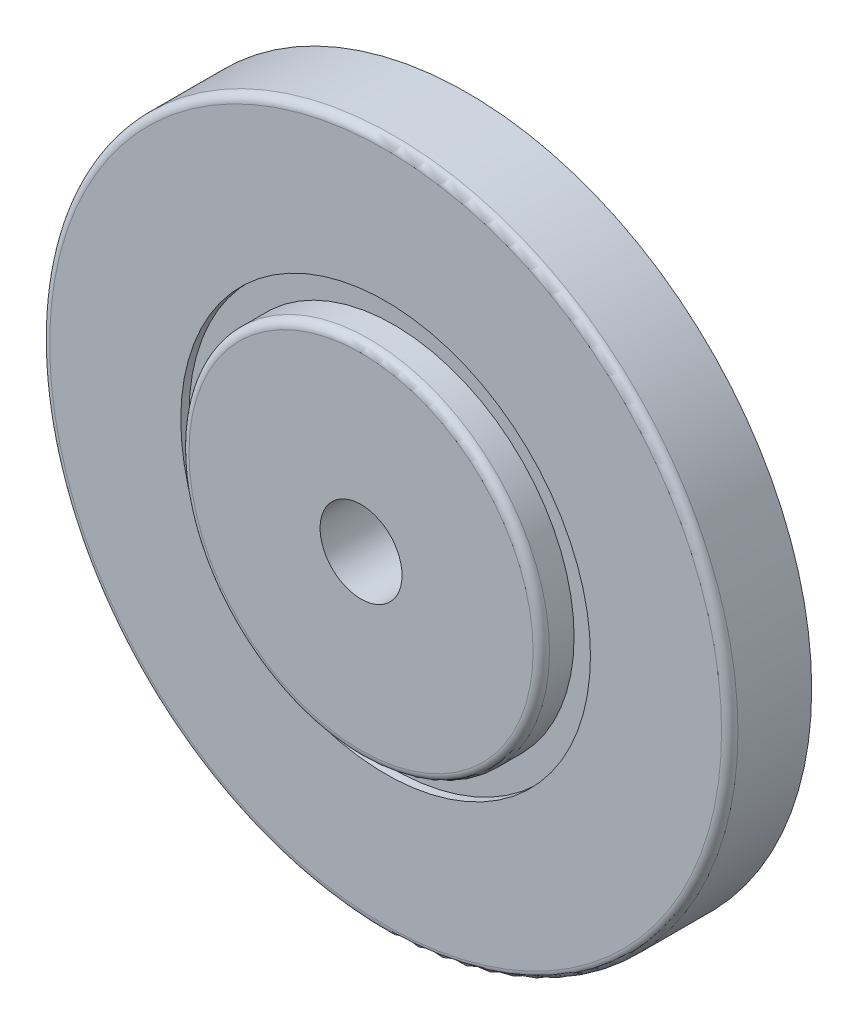
ISO-10303-21;
HEADER;
FILE_DESCRIPTION(('STEP AP214'),'2;1');
FILE_NAME('part.step','',(''),(''),'','','');
FILE_SCHEMA(('AUTOMOTIVE_DESIGN { 1 0 10303 214 1 1 1 1 }'));
ENDSEC;
DATA;
#1=APPLICATION_CONTEXT('core data for automotive mechanical design processes');
#2=APPLICATION_PROTOCOL_DEFINITION('international standard','automotive_design',2000,#1);
#3=PRODUCT_CONTEXT('',#1,'mechanical');
#4=PRODUCT('Part','Part','',(#3));
#5=PRODUCT_RELATED_PRODUCT_CATEGORY('part','',(#4));
#6=PRODUCT_DEFINITION_FORMATION('','',#4);
#7=PRODUCT_DEFINITION_CONTEXT('part definition',#1,'design');
#8=PRODUCT_DEFINITION('design','',#6,#7);
#9=PRODUCT_DEFINITION_SHAPE('','',#8);
#10=(LENGTH_UNIT() NAMED_UNIT(*) SI_UNIT(.MILLI.,.METRE.));
#11=(NAMED_UNIT(*) PLANE_ANGLE_UNIT() SI_UNIT($,.RADIAN.));
#12=(NAMED_UNIT(*) SI_UNIT($,.STERADIAN.) SOLID_ANGLE_UNIT());
#13=UNCERTAINTY_MEASURE_WITH_UNIT(LENGTH_MEASURE(1.E-05),#10,'distance_accuracy_value','');
#14=(GEOMETRIC_REPRESENTATION_CONTEXT(3) GLOBAL_UNCERTAINTY_ASSIGNED_CONTEXT((#13)) GLOBAL_UNIT_ASSIGNED_CONTEXT((#10,
#11,#12)) REPRESENTATION_CONTEXT('',''));
#15=CARTESIAN_POINT('',(0.,0.,0.));
#16=DIRECTION('',(0.,0.,1.));
#17=DIRECTION('',(1.,0.,0.));
#18=AXIS2_PLACEMENT_3D('',#15,#16,#17);
#19=CARTESIAN_POINT('',(0.,0.,5.));
#20=DIRECTION('',(0.,0.,-1.));
#21=DIRECTION('',(-1.,0.,0.));
#22=AXIS2_PLACEMENT_3D('',#19,#20,#21);
#23=CYLINDRICAL_SURFACE('',#22,21.);
#24=CARTESIAN_POINT('',(0.,0.,4.5));
#25=DIRECTION('',(0.,0.,1.));
#26=DIRECTION('',(1.,0.,0.));
#27=AXIS2_PLACEMENT_3D('',#24,#25,#26);
#28=CIRCLE('',#27,21.);
#29=CARTESIAN_POINT('',(21.,0.,4.5));
#30=VERTEX_POINT('',#29);
#31=EDGE_CURVE('E41',#30,#30,#28,.F.);
#32=ORIENTED_EDGE('',*,*,#31,.T.);
#33=EDGE_LOOP('',(#32));
#34=FACE_BOUND('',#33,.T.);
#35=CARTESIAN_POINT('',(0.,0.,0.));
#36=DIRECTION('',(0.,0.,1.));
#37=DIRECTION('',(1.,0.,0.));
#38=AXIS2_PLACEMENT_3D('',#35,#36,#37);
#39=CIRCLE('',#38,21.);
#40=CARTESIAN_POINT('',(21.,0.,0.));
#41=VERTEX_POINT('',#40);
#42=EDGE_CURVE('E50',#41,#41,#39,.T.);
#43=ORIENTED_EDGE('',*,*,#42,.T.);
#44=EDGE_LOOP('',(#43));
#45=FACE_BOUND('',#44,.T.);
#46=ADVANCED_FACE('F30',(#34,#45),#23,.T.);
#47=CARTESIAN_POINT('',(0.,0.,5.));
#48=DIRECTION('',(0.,0.,1.));
#49=DIRECTION('',(1.,0.,0.));
#50=AXIS2_PLACEMENT_3D('',#47,#48,#49);
#51=PLANE('',#50);
#52=CARTESIAN_POINT('',(0.,0.,5.));
#53=DIRECTION('',(0.,0.,1.));
#54=DIRECTION('',(1.,0.,0.));
#55=AXIS2_PLACEMENT_3D('',#52,#53,#54);
#56=CIRCLE('',#55,20.5);
#57=CARTESIAN_POINT('',(20.5,0.,5.));
#58=VERTEX_POINT('',#57);
#59=EDGE_CURVE('E45',#58,#58,#56,.T.);
#60=ORIENTED_EDGE('',*,*,#59,.T.);
#61=EDGE_LOOP('',(#60));
#62=FACE_BOUND('',#61,.T.);
#63=CARTESIAN_POINT('',(0.,0.,5.));
#64=DIRECTION('',(0.,0.,1.));
#65=DIRECTION('',(1.,0.,0.));
#66=AXIS2_PLACEMENT_3D('',#63,#64,#65);
#67=CIRCLE('',#66,12.5);
#68=CARTESIAN_POINT('',(12.5,0.,5.));
#69=VERTEX_POINT('',#68);
#70=EDGE_CURVE('E54',#69,#69,#67,.T.);
#71=ORIENTED_EDGE('',*,*,#70,.F.);
#72=EDGE_LOOP('',(#71));
#73=FACE_BOUND('',#72,.T.);
#74=ADVANCED_FACE('F89',(#62,#73),#51,.T.);
#75=CARTESIAN_POINT('',(0.,0.,0.));
#76=DIRECTION('',(0.,0.,1.));
#77=DIRECTION('',(1.,0.,0.));
#78=AXIS2_PLACEMENT_3D('',#75,#76,#77);
#79=PLANE('',#78);
#80=CARTESIAN_POINT('',(0.,0.,0.));
#81=DIRECTION('',(0.,0.,1.));
#82=DIRECTION('',(1.,0.,0.));
#83=AXIS2_PLACEMENT_3D('',#80,#81,#82);
#84=CIRCLE('',#83,2.5);
#85=CARTESIAN_POINT('',(2.5,0.,0.));
#86=VERTEX_POINT('',#85);
#87=EDGE_CURVE('E62',#86,#86,#84,.T.);
#88=ORIENTED_EDGE('',*,*,#87,.T.);
#89=EDGE_LOOP('',(#88));
#90=FACE_BOUND('',#89,.T.);
#91=ORIENTED_EDGE('',*,*,#42,.F.);
#92=EDGE_LOOP('',(#91));
#93=FACE_BOUND('',#92,.T.);
#94=ADVANCED_FACE('F69',(#90,#93),#79,.F.);
#95=CARTESIAN_POINT('',(0.,0.,4.5));
#96=DIRECTION('',(0.,0.,1.));
#97=DIRECTION('',(1.,0.,0.));
#98=AXIS2_PLACEMENT_3D('',#95,#96,#97);
#99=CYLINDRICAL_SURFACE('',#98,12.5);
#100=CARTESIAN_POINT('',(0.,0.,4.5));
#101=DIRECTION('',(0.,0.,1.));
#102=DIRECTION('',(1.,0.,0.));
#103=AXIS2_PLACEMENT_3D('',#100,#101,#102);
#104=CIRCLE('',#103,12.5);
#105=CARTESIAN_POINT('',(12.5,0.,4.5));
#106=VERTEX_POINT('',#105);
#107=EDGE_CURVE('E53',#106,#106,#104,.T.);
#108=ORIENTED_EDGE('',*,*,#107,.F.);
#109=EDGE_LOOP('',(#108));
#110=FACE_BOUND('',#109,.T.);
#111=ORIENTED_EDGE('',*,*,#70,.T.);
#112=EDGE_LOOP('',(#111));
#113=FACE_BOUND('',#112,.T.);
#114=ADVANCED_FACE('F111',(#110,#113),#99,.F.);
#115=CARTESIAN_POINT('',(0.,0.,4.5));
#116=DIRECTION('',(0.,0.,1.));
#117=DIRECTION('',(1.,0.,0.));
#118=AXIS2_PLACEMENT_3D('',#115,#116,#117);
#119=PLANE('',#118);
#120=CARTESIAN_POINT('',(0.,0.,4.5));
#121=DIRECTION('',(0.,0.,1.));
#122=DIRECTION('',(1.,0.,0.));
#123=AXIS2_PLACEMENT_3D('',#120,#121,#122);
#124=CIRCLE('',#123,11.);
#125=CARTESIAN_POINT('',(11.,0.,4.5));
#126=VERTEX_POINT('',#125);
#127=EDGE_CURVE('E57',#126,#126,#124,.T.);
#128=ORIENTED_EDGE('',*,*,#127,.F.);
#129=EDGE_LOOP('',(#128));
#130=FACE_BOUND('',#129,.T.);
#131=ORIENTED_EDGE('',*,*,#107,.T.);
#132=EDGE_LOOP('',(#131));
#133=FACE_BOUND('',#132,.T.);
#134=ADVANCED_FACE('F86',(#130,#133),#119,.T.);
#135=CARTESIAN_POINT('',(0.,0.,6.5));
#136=DIRECTION('',(0.,0.,-1.));
#137=DIRECTION('',(-1.,0.,0.));
#138=AXIS2_PLACEMENT_3D('',#135,#136,#137);
#139=CYLINDRICAL_SURFACE('',#138,11.);
#140=CARTESIAN_POINT('',(0.,0.,6.));
#141=DIRECTION('',(0.,0.,1.));
#142=DIRECTION('',(1.,0.,0.));
#143=AXIS2_PLACEMENT_3D('',#140,#141,#142);
#144=CIRCLE('',#143,11.);
#145=CARTESIAN_POINT('',(11.,0.,6.));
#146=VERTEX_POINT('',#145);
#147=EDGE_CURVE('E10',#146,#146,#144,.F.);
#148=ORIENTED_EDGE('',*,*,#147,.T.);
#149=EDGE_LOOP('',(#148));
#150=FACE_BOUND('',#149,.T.);
#151=ORIENTED_EDGE('',*,*,#127,.T.);
#152=EDGE_LOOP('',(#151));
#153=FACE_BOUND('',#152,.T.);
#154=ADVANCED_FACE('F81',(#150,#153),#139,.T.);
#155=CARTESIAN_POINT('',(0.,0.,6.5));
#156=DIRECTION('',(0.,0.,1.));
#157=DIRECTION('',(1.,0.,0.));
#158=AXIS2_PLACEMENT_3D('',#155,#156,#157);
#159=PLANE('',#158);
#160=CARTESIAN_POINT('',(0.,0.,6.5));
#161=DIRECTION('',(0.,0.,1.));
#162=DIRECTION('',(1.,0.,0.));
#163=AXIS2_PLACEMENT_3D('',#160,#161,#162);
#164=CIRCLE('',#163,10.5);
#165=CARTESIAN_POINT('',(10.5,0.,6.5));
#166=VERTEX_POINT('',#165);
#167=EDGE_CURVE('E37',#166,#166,#164,.T.);
#168=ORIENTED_EDGE('',*,*,#167,.T.);
#169=EDGE_LOOP('',(#168));
#170=FACE_BOUND('',#169,.T.);
#171=CARTESIAN_POINT('',(0.,0.,6.5));
#172=DIRECTION('',(0.,0.,1.));
#173=DIRECTION('',(1.,0.,0.));
#174=AXIS2_PLACEMENT_3D('',#171,#172,#173);
#175=CIRCLE('',#174,2.5);
#176=CARTESIAN_POINT('',(2.5,0.,6.5));
#177=VERTEX_POINT('',#176);
#178=EDGE_CURVE('E63',#177,#177,#175,.T.);
#179=ORIENTED_EDGE('',*,*,#178,.F.);
#180=EDGE_LOOP('',(#179));
#181=FACE_BOUND('',#180,.T.);
#182=ADVANCED_FACE('F76',(#170,#181),#159,.T.);
#183=CARTESIAN_POINT('',(0.,0.,0.));
#184=DIRECTION('',(0.,0.,1.));
#185=DIRECTION('',(1.,0.,0.));
#186=AXIS2_PLACEMENT_3D('',#183,#184,#185);
#187=CYLINDRICAL_SURFACE('',#186,2.5);
#188=ORIENTED_EDGE('',*,*,#87,.F.);
#189=EDGE_LOOP('',(#188));
#190=FACE_BOUND('',#189,.T.);
#191=ORIENTED_EDGE('',*,*,#178,.T.);
#192=EDGE_LOOP('',(#191));
#193=FACE_BOUND('',#192,.T.);
#194=ADVANCED_FACE('F72',(#190,#193),#187,.F.);
#195=CARTESIAN_POINT('',(0.,0.,4.5));
#196=DIRECTION('',(0.,0.,1.));
#197=DIRECTION('',(1.,0.,0.));
#198=AXIS2_PLACEMENT_3D('',#195,#196,#197);
#199=TOROIDAL_SURFACE('',#198,20.5,0.499999999999997);
#200=ORIENTED_EDGE('',*,*,#31,.F.);
#201=EDGE_LOOP('',(#200));
#202=FACE_BOUND('',#201,.T.);
#203=ORIENTED_EDGE('',*,*,#59,.F.);
#204=EDGE_LOOP('',(#203));
#205=FACE_BOUND('',#204,.T.);
#206=ADVANCED_FACE('F75',(#202,#205),#199,.T.);
#207=CARTESIAN_POINT('',(0.,0.,6.));
#208=DIRECTION('',(0.,0.,1.));
#209=DIRECTION('',(1.,0.,0.));
#210=AXIS2_PLACEMENT_3D('',#207,#208,#209);
#211=TOROIDAL_SURFACE('',#210,10.5,0.499999999999997);
#212=ORIENTED_EDGE('',*,*,#147,.F.);
#213=EDGE_LOOP('',(#212));
#214=FACE_BOUND('',#213,.T.);
#215=ORIENTED_EDGE('',*,*,#167,.F.);
#216=EDGE_LOOP('',(#215));
#217=FACE_BOUND('',#216,.T.);
#218=ADVANCED_FACE('F32',(#214,#217),#211,.T.);
#219=CLOSED_SHELL('',(#46,#74,#94,#114,#134,#154,#182,#194,#206,#218));
#220=MANIFOLD_SOLID_BREP('B2',#219);
#221=ADVANCED_BREP_SHAPE_REPRESENTATION('',(#18,#220),#14);
#222=SHAPE_DEFINITION_REPRESENTATION(#9,#221);
ENDSEC;
END-ISO-10303-21;
